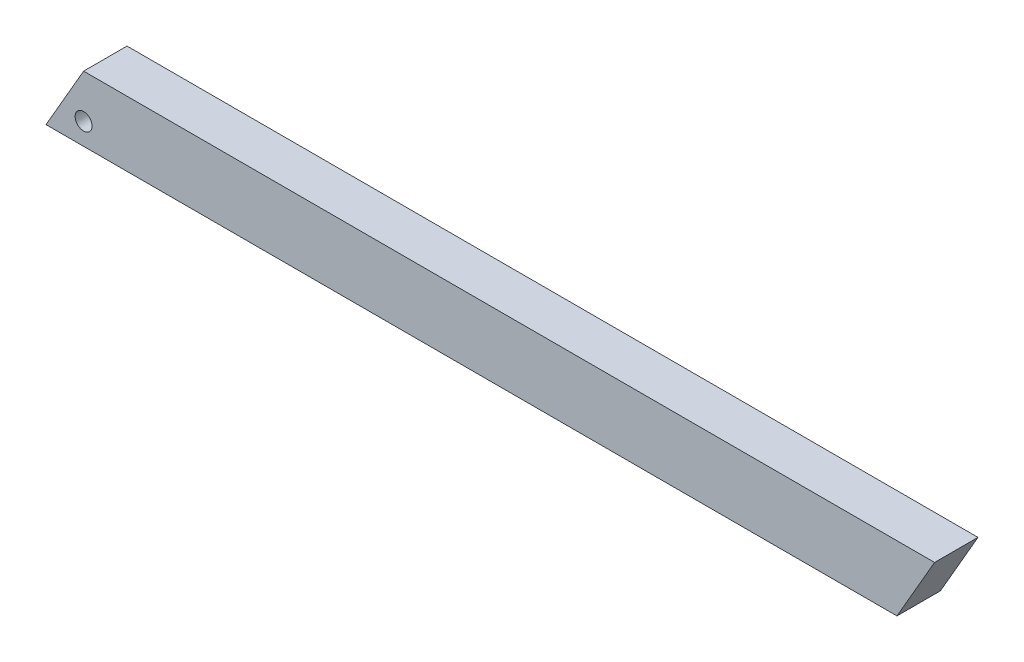
ISO-10303-21;
HEADER;
FILE_DESCRIPTION(('STEP AP214'),'2;1');
FILE_NAME('part.step','',(''),(''),'','','');
FILE_SCHEMA(('AUTOMOTIVE_DESIGN { 1 0 10303 214 1 1 1 1 }'));
ENDSEC;
DATA;
#1=APPLICATION_CONTEXT('core data for automotive mechanical design processes');
#2=APPLICATION_PROTOCOL_DEFINITION('international standard','automotive_design',2000,#1);
#3=PRODUCT_CONTEXT('',#1,'mechanical');
#4=PRODUCT('Part','Part','',(#3));
#5=PRODUCT_RELATED_PRODUCT_CATEGORY('part','',(#4));
#6=PRODUCT_DEFINITION_FORMATION('','',#4);
#7=PRODUCT_DEFINITION_CONTEXT('part definition',#1,'design');
#8=PRODUCT_DEFINITION('design','',#6,#7);
#9=PRODUCT_DEFINITION_SHAPE('','',#8);
#10=(LENGTH_UNIT() NAMED_UNIT(*) SI_UNIT(.MILLI.,.METRE.));
#11=(NAMED_UNIT(*) PLANE_ANGLE_UNIT() SI_UNIT($,.RADIAN.));
#12=(NAMED_UNIT(*) SI_UNIT($,.STERADIAN.) SOLID_ANGLE_UNIT());
#13=UNCERTAINTY_MEASURE_WITH_UNIT(LENGTH_MEASURE(1.E-05),#10,'distance_accuracy_value','');
#14=(GEOMETRIC_REPRESENTATION_CONTEXT(3) GLOBAL_UNCERTAINTY_ASSIGNED_CONTEXT((#13)) GLOBAL_UNIT_ASSIGNED_CONTEXT((#10,
#11,#12)) REPRESENTATION_CONTEXT('',''));
#15=CARTESIAN_POINT('',(0.,0.,0.));
#16=DIRECTION('',(0.,0.,1.));
#17=DIRECTION('',(1.,0.,0.));
#18=AXIS2_PLACEMENT_3D('',#15,#16,#17);
#19=CARTESIAN_POINT('',(0.,0.,25.4));
#20=DIRECTION('',(0.,0.,-1.));
#21=DIRECTION('',(-1.,0.,0.));
#22=AXIS2_PLACEMENT_3D('',#19,#20,#21);
#23=PLANE('',#22);
#24=DIRECTION('',(0.499999999999993,0.866025403784443,0.));
#25=VECTOR('',#24,1.);
#26=CARTESIAN_POINT('',(248.868157838,0.,25.4));
#27=LINE('',#26,#25);
#28=CARTESIAN_POINT('',(237.869635209938,-19.05,25.4));
#29=VERTEX_POINT('',#28);
#30=CARTESIAN_POINT('',(259.866680466062,19.05,25.4));
#31=VERTEX_POINT('',#30);
#32=EDGE_CURVE('E52',#29,#31,#27,.T.);
#33=ORIENTED_EDGE('',*,*,#32,.T.);
#34=DIRECTION('',(-1.,0.,0.));
#35=VECTOR('',#34,1.);
#36=CARTESIAN_POINT('',(-237.869635209938,19.05,25.4));
#37=LINE('',#36,#35);
#38=CARTESIAN_POINT('',(-237.869635209938,19.05,25.4));
#39=VERTEX_POINT('',#38);
#40=EDGE_CURVE('E82',#31,#39,#37,.T.);
#41=ORIENTED_EDGE('',*,*,#40,.T.);
#42=DIRECTION('',(-0.499999999999991,-0.866025403784444,0.));
#43=VECTOR('',#42,1.);
#44=CARTESIAN_POINT('',(-248.868157838,0.,25.4));
#45=LINE('',#44,#43);
#46=CARTESIAN_POINT('',(-259.866680466062,-19.05,25.4));
#47=VERTEX_POINT('',#46);
#48=EDGE_CURVE('E86',#39,#47,#45,.T.);
#49=ORIENTED_EDGE('',*,*,#48,.T.);
#50=DIRECTION('',(1.,0.,0.));
#51=VECTOR('',#50,1.);
#52=CARTESIAN_POINT('',(-259.866680466062,-19.05,25.4));
#53=LINE('',#52,#51);
#54=EDGE_CURVE('E94',#47,#29,#53,.T.);
#55=ORIENTED_EDGE('',*,*,#54,.T.);
#56=EDGE_LOOP('',(#33,#41,#49,#55));
#57=FACE_BOUND('',#56,.T.);
#58=CARTESIAN_POINT('',(-237.869635209938,-6.35,25.4));
#59=DIRECTION('',(0.,0.,1.));
#60=DIRECTION('',(1.,0.,0.));
#61=AXIS2_PLACEMENT_3D('',#58,#59,#60);
#62=CIRCLE('',#61,4.95952983374082);
#63=CARTESIAN_POINT('',(-232.910105376197,-6.35,25.4));
#64=VERTEX_POINT('',#63);
#65=EDGE_CURVE('E101',#64,#64,#62,.T.);
#66=ORIENTED_EDGE('',*,*,#65,.F.);
#67=EDGE_LOOP('',(#66));
#68=FACE_BOUND('',#67,.T.);
#69=ADVANCED_FACE('F35',(#57,#68),#23,.F.);
#70=CARTESIAN_POINT('',(0.,0.,0.));
#71=DIRECTION('',(0.,0.,-1.));
#72=DIRECTION('',(-1.,0.,0.));
#73=AXIS2_PLACEMENT_3D('',#70,#71,#72);
#74=PLANE('',#73);
#75=DIRECTION('',(-1.,0.,0.));
#76=VECTOR('',#75,1.);
#77=CARTESIAN_POINT('',(-237.869635209938,19.05,0.));
#78=LINE('',#77,#76);
#79=CARTESIAN_POINT('',(259.866680466062,19.05,0.));
#80=VERTEX_POINT('',#79);
#81=CARTESIAN_POINT('',(-237.869635209938,19.05,0.));
#82=VERTEX_POINT('',#81);
#83=EDGE_CURVE('E90',#80,#82,#78,.T.);
#84=ORIENTED_EDGE('',*,*,#83,.F.);
#85=DIRECTION('',(0.499999999999993,0.866025403784443,0.));
#86=VECTOR('',#85,1.);
#87=CARTESIAN_POINT('',(248.868157838,0.,0.));
#88=LINE('',#87,#86);
#89=CARTESIAN_POINT('',(237.869635209938,-19.05,0.));
#90=VERTEX_POINT('',#89);
#91=EDGE_CURVE('E104',#90,#80,#88,.T.);
#92=ORIENTED_EDGE('',*,*,#91,.F.);
#93=DIRECTION('',(1.,0.,0.));
#94=VECTOR('',#93,1.);
#95=CARTESIAN_POINT('',(-259.866680466062,-19.05,0.));
#96=LINE('',#95,#94);
#97=CARTESIAN_POINT('',(-259.866680466062,-19.05,0.));
#98=VERTEX_POINT('',#97);
#99=EDGE_CURVE('E76',#98,#90,#96,.T.);
#100=ORIENTED_EDGE('',*,*,#99,.F.);
#101=DIRECTION('',(-0.499999999999991,-0.866025403784444,0.));
#102=VECTOR('',#101,1.);
#103=CARTESIAN_POINT('',(-248.868157838,0.,0.));
#104=LINE('',#103,#102);
#105=EDGE_CURVE('E69',#82,#98,#104,.T.);
#106=ORIENTED_EDGE('',*,*,#105,.F.);
#107=EDGE_LOOP('',(#84,#92,#100,#106));
#108=FACE_BOUND('',#107,.T.);
#109=CARTESIAN_POINT('',(-237.869635209938,-6.35,0.));
#110=DIRECTION('',(0.,0.,1.));
#111=DIRECTION('',(1.,0.,0.));
#112=AXIS2_PLACEMENT_3D('',#109,#110,#111);
#113=CIRCLE('',#112,4.95952983374082);
#114=CARTESIAN_POINT('',(-232.910105376197,-6.35,0.));
#115=VERTEX_POINT('',#114);
#116=EDGE_CURVE('E180',#115,#115,#113,.T.);
#117=ORIENTED_EDGE('',*,*,#116,.T.);
#118=EDGE_LOOP('',(#117));
#119=FACE_BOUND('',#118,.T.);
#120=ADVANCED_FACE('F110',(#108,#119),#74,.T.);
#121=CARTESIAN_POINT('',(-237.869635209938,19.05,25.4));
#122=DIRECTION('',(0.,-1.,0.));
#123=DIRECTION('',(0.,0.,-1.));
#124=AXIS2_PLACEMENT_3D('',#121,#122,#123);
#125=PLANE('',#124);
#126=ORIENTED_EDGE('',*,*,#83,.T.);
#127=DIRECTION('',(0.,0.,-1.));
#128=VECTOR('',#127,1.);
#129=CARTESIAN_POINT('',(-237.869635209938,19.05,25.4));
#130=LINE('',#129,#128);
#131=EDGE_CURVE('E44',#39,#82,#130,.T.);
#132=ORIENTED_EDGE('',*,*,#131,.F.);
#133=ORIENTED_EDGE('',*,*,#40,.F.);
#134=DIRECTION('',(0.,0.,-1.));
#135=VECTOR('',#134,1.);
#136=CARTESIAN_POINT('',(259.866680466062,19.05,25.4));
#137=LINE('',#136,#135);
#138=EDGE_CURVE('E11',#31,#80,#137,.T.);
#139=ORIENTED_EDGE('',*,*,#138,.T.);
#140=EDGE_LOOP('',(#126,#132,#133,#139));
#141=FACE_BOUND('',#140,.T.);
#142=ADVANCED_FACE('F37',(#141),#125,.F.);
#143=CARTESIAN_POINT('',(-248.868157838,0.,25.4));
#144=DIRECTION('',(0.866025403784444,-0.499999999999991,0.));
#145=DIRECTION('',(0.499999999999991,0.866025403784444,0.));
#146=AXIS2_PLACEMENT_3D('',#143,#144,#145);
#147=PLANE('',#146);
#148=ORIENTED_EDGE('',*,*,#105,.T.);
#149=DIRECTION('',(0.,0.,-1.));
#150=VECTOR('',#149,1.);
#151=CARTESIAN_POINT('',(-259.866680466062,-19.05,25.4));
#152=LINE('',#151,#150);
#153=EDGE_CURVE('E91',#47,#98,#152,.T.);
#154=ORIENTED_EDGE('',*,*,#153,.F.);
#155=ORIENTED_EDGE('',*,*,#48,.F.);
#156=ORIENTED_EDGE('',*,*,#131,.T.);
#157=EDGE_LOOP('',(#148,#154,#155,#156));
#158=FACE_BOUND('',#157,.T.);
#159=ADVANCED_FACE('F92',(#158),#147,.F.);
#160=CARTESIAN_POINT('',(-259.866680466062,-19.05,25.4));
#161=DIRECTION('',(0.,1.,0.));
#162=DIRECTION('',(-1.,0.,0.));
#163=AXIS2_PLACEMENT_3D('',#160,#161,#162);
#164=PLANE('',#163);
#165=ORIENTED_EDGE('',*,*,#99,.T.);
#166=DIRECTION('',(0.,0.,-1.));
#167=VECTOR('',#166,1.);
#168=CARTESIAN_POINT('',(237.869635209938,-19.05,25.4));
#169=LINE('',#168,#167);
#170=EDGE_CURVE('E96',#29,#90,#169,.T.);
#171=ORIENTED_EDGE('',*,*,#170,.F.);
#172=ORIENTED_EDGE('',*,*,#54,.F.);
#173=ORIENTED_EDGE('',*,*,#153,.T.);
#174=EDGE_LOOP('',(#165,#171,#172,#173));
#175=FACE_BOUND('',#174,.T.);
#176=ADVANCED_FACE('F107',(#175),#164,.F.);
#177=CARTESIAN_POINT('',(248.868157838,0.,25.4));
#178=DIRECTION('',(-0.866025403784443,0.499999999999993,0.));
#179=DIRECTION('',(-0.499999999999993,-0.866025403784443,0.));
#180=AXIS2_PLACEMENT_3D('',#177,#178,#179);
#181=PLANE('',#180);
#182=ORIENTED_EDGE('',*,*,#91,.T.);
#183=ORIENTED_EDGE('',*,*,#138,.F.);
#184=ORIENTED_EDGE('',*,*,#32,.F.);
#185=ORIENTED_EDGE('',*,*,#170,.T.);
#186=EDGE_LOOP('',(#182,#183,#184,#185));
#187=FACE_BOUND('',#186,.T.);
#188=ADVANCED_FACE('F112',(#187),#181,.F.);
#189=CARTESIAN_POINT('',(-237.869635209938,-6.35,25.4));
#190=DIRECTION('',(0.,0.,-1.));
#191=DIRECTION('',(-1.,0.,0.));
#192=AXIS2_PLACEMENT_3D('',#189,#190,#191);
#193=CYLINDRICAL_SURFACE('',#192,4.95952983374082);
#194=ORIENTED_EDGE('',*,*,#65,.T.);
#195=EDGE_LOOP('',(#194));
#196=FACE_BOUND('',#195,.T.);
#197=ORIENTED_EDGE('',*,*,#116,.F.);
#198=EDGE_LOOP('',(#197));
#199=FACE_BOUND('',#198,.T.);
#200=ADVANCED_FACE('F114',(#196,#199),#193,.F.);
#201=CLOSED_SHELL('',(#69,#120,#142,#159,#176,#188,#200));
#202=MANIFOLD_SOLID_BREP('B2',#201);
#203=ADVANCED_BREP_SHAPE_REPRESENTATION('',(#18,#202),#14);
#204=SHAPE_DEFINITION_REPRESENTATION(#9,#203);
ENDSEC;
END-ISO-10303-21;
